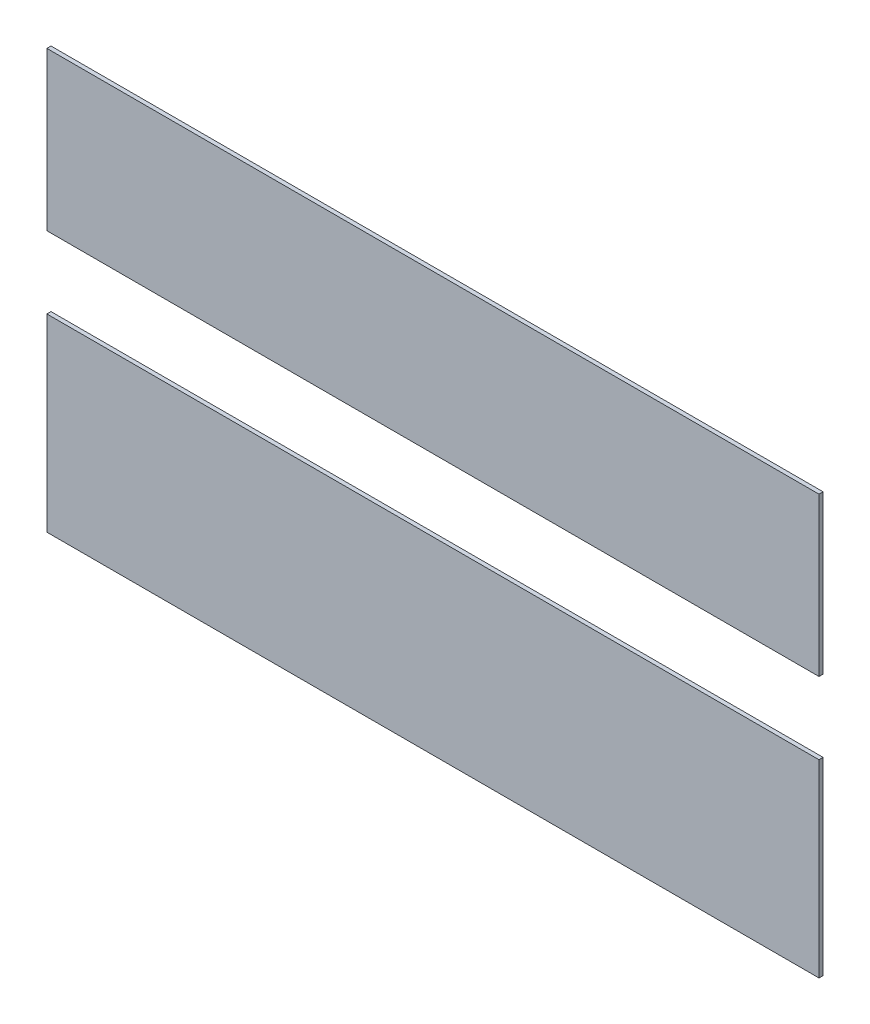
ISO-10303-21;
HEADER;
FILE_DESCRIPTION(('STEP AP214'),'2;1');
FILE_NAME('part.step','',(''),(''),'','','');
FILE_SCHEMA(('AUTOMOTIVE_DESIGN { 1 0 10303 214 1 1 1 1 }'));
ENDSEC;
DATA;
#1=APPLICATION_CONTEXT('core data for automotive mechanical design processes');
#2=APPLICATION_PROTOCOL_DEFINITION('international standard','automotive_design',2000,#1);
#3=PRODUCT_CONTEXT('',#1,'mechanical');
#4=PRODUCT('Part','Part','',(#3));
#5=PRODUCT_RELATED_PRODUCT_CATEGORY('part','',(#4));
#6=PRODUCT_DEFINITION_FORMATION('','',#4);
#7=PRODUCT_DEFINITION_CONTEXT('part definition',#1,'design');
#8=PRODUCT_DEFINITION('design','',#6,#7);
#9=PRODUCT_DEFINITION_SHAPE('','',#8);
#10=(LENGTH_UNIT() NAMED_UNIT(*) SI_UNIT(.MILLI.,.METRE.));
#11=(NAMED_UNIT(*) PLANE_ANGLE_UNIT() SI_UNIT($,.RADIAN.));
#12=(NAMED_UNIT(*) SI_UNIT($,.STERADIAN.) SOLID_ANGLE_UNIT());
#13=UNCERTAINTY_MEASURE_WITH_UNIT(LENGTH_MEASURE(1.E-05),#10,'distance_accuracy_value','');
#14=(GEOMETRIC_REPRESENTATION_CONTEXT(3) GLOBAL_UNCERTAINTY_ASSIGNED_CONTEXT((#13)) GLOBAL_UNIT_ASSIGNED_CONTEXT((#10,
#11,#12)) REPRESENTATION_CONTEXT('',''));
#15=CARTESIAN_POINT('',(0.,0.,0.));
#16=DIRECTION('',(0.,0.,1.));
#17=DIRECTION('',(1.,0.,0.));
#18=AXIS2_PLACEMENT_3D('',#15,#16,#17);
#19=CARTESIAN_POINT('',(9968.34448257996,14202.06060864,2.));
#20=DIRECTION('',(1.,0.,0.));
#21=DIRECTION('',(0.,1.,0.));
#22=AXIS2_PLACEMENT_3D('',#19,#20,#21);
#23=PLANE('',#22);
#24=DIRECTION('',(0.,-1.,0.));
#25=VECTOR('',#24,1.);
#26=CARTESIAN_POINT('',(9968.34448257996,14202.06060864,0.));
#27=LINE('',#26,#25);
#28=CARTESIAN_POINT('',(9968.34448257995,14405.5579740348,0.));
#29=VERTEX_POINT('',#28);
#30=CARTESIAN_POINT('',(9968.34448257995,14328.8579740348,0.));
#31=VERTEX_POINT('',#30);
#32=EDGE_CURVE('E47',#29,#31,#27,.T.);
#33=ORIENTED_EDGE('',*,*,#32,.T.);
#34=DIRECTION('',(0.,0.,1.));
#35=VECTOR('',#34,1.);
#36=CARTESIAN_POINT('',(9968.34448257995,14328.8579740348,-8.));
#37=LINE('',#36,#35);
#38=CARTESIAN_POINT('',(9968.34448257995,14328.8579740348,2.));
#39=VERTEX_POINT('',#38);
#40=EDGE_CURVE('E61',#31,#39,#37,.T.);
#41=ORIENTED_EDGE('',*,*,#40,.T.);
#42=DIRECTION('',(0.,-1.,0.));
#43=VECTOR('',#42,1.);
#44=CARTESIAN_POINT('',(9968.34448257996,14202.06060864,2.));
#45=LINE('',#44,#43);
#46=CARTESIAN_POINT('',(9968.34448257995,14405.5579740348,2.));
#47=VERTEX_POINT('',#46);
#48=EDGE_CURVE('E92',#47,#39,#45,.T.);
#49=ORIENTED_EDGE('',*,*,#48,.F.);
#50=DIRECTION('',(0.,0.,-1.));
#51=VECTOR('',#50,1.);
#52=CARTESIAN_POINT('',(9968.34448257995,14405.5579740348,2.));
#53=LINE('',#52,#51);
#54=EDGE_CURVE('E104',#47,#29,#53,.T.);
#55=ORIENTED_EDGE('',*,*,#54,.T.);
#56=EDGE_LOOP('',(#33,#41,#49,#55));
#57=FACE_BOUND('',#56,.T.);
#58=ADVANCED_FACE('F44',(#57),#23,.F.);
#59=CARTESIAN_POINT('',(10343.3422993769,14405.5579740348,2.));
#60=DIRECTION('',(-1.,0.,0.));
#61=DIRECTION('',(0.,-1.,0.));
#62=AXIS2_PLACEMENT_3D('',#59,#60,#61);
#63=PLANE('',#62);
#64=DIRECTION('',(0.,1.,0.));
#65=VECTOR('',#64,1.);
#66=CARTESIAN_POINT('',(10343.3422993769,14405.5579740348,2.));
#67=LINE('',#66,#65);
#68=CARTESIAN_POINT('',(10343.3422993769,14328.8579740348,2.));
#69=VERTEX_POINT('',#68);
#70=CARTESIAN_POINT('',(10343.3422993769,14405.5579740348,2.));
#71=VERTEX_POINT('',#70);
#72=EDGE_CURVE('E89',#69,#71,#67,.T.);
#73=ORIENTED_EDGE('',*,*,#72,.F.);
#74=DIRECTION('',(0.,0.,1.));
#75=VECTOR('',#74,1.);
#76=CARTESIAN_POINT('',(10343.3422993769,14328.8579740348,-8.));
#77=LINE('',#76,#75);
#78=CARTESIAN_POINT('',(10343.3422993769,14328.8579740348,0.));
#79=VERTEX_POINT('',#78);
#80=EDGE_CURVE('E53',#79,#69,#77,.T.);
#81=ORIENTED_EDGE('',*,*,#80,.F.);
#82=DIRECTION('',(0.,1.,0.));
#83=VECTOR('',#82,1.);
#84=CARTESIAN_POINT('',(10343.3422993769,14405.5579740348,0.));
#85=LINE('',#84,#83);
#86=CARTESIAN_POINT('',(10343.3422993769,14405.5579740348,0.));
#87=VERTEX_POINT('',#86);
#88=EDGE_CURVE('E101',#79,#87,#85,.T.);
#89=ORIENTED_EDGE('',*,*,#88,.T.);
#90=DIRECTION('',(0.,0.,-1.));
#91=VECTOR('',#90,1.);
#92=CARTESIAN_POINT('',(10343.3422993769,14405.5579740348,2.));
#93=LINE('',#92,#91);
#94=EDGE_CURVE('E95',#71,#87,#93,.T.);
#95=ORIENTED_EDGE('',*,*,#94,.F.);
#96=EDGE_LOOP('',(#73,#81,#89,#95));
#97=FACE_BOUND('',#96,.T.);
#98=ADVANCED_FACE('F93',(#97),#63,.F.);
#99=CARTESIAN_POINT('',(0.,0.,2.));
#100=DIRECTION('',(0.,0.,-1.));
#101=DIRECTION('',(-1.,0.,0.));
#102=AXIS2_PLACEMENT_3D('',#99,#100,#101);
#103=PLANE('',#102);
#104=ORIENTED_EDGE('',*,*,#48,.T.);
#105=DIRECTION('',(-1.,0.,0.));
#106=VECTOR('',#105,1.);
#107=CARTESIAN_POINT('',(9968.34448257995,14328.8579740348,2.));
#108=LINE('',#107,#106);
#109=EDGE_CURVE('E12',#69,#39,#108,.T.);
#110=ORIENTED_EDGE('',*,*,#109,.F.);
#111=ORIENTED_EDGE('',*,*,#72,.T.);
#112=DIRECTION('',(-1.,0.,0.));
#113=VECTOR('',#112,1.);
#114=CARTESIAN_POINT('',(10323.34448258,14405.5579740348,2.));
#115=LINE('',#114,#113);
#116=EDGE_CURVE('E97',#71,#47,#115,.T.);
#117=ORIENTED_EDGE('',*,*,#116,.T.);
#118=EDGE_LOOP('',(#104,#110,#111,#117));
#119=FACE_BOUND('',#118,.T.);
#120=ADVANCED_FACE('F88',(#119),#103,.F.);
#121=CARTESIAN_POINT('',(0.,0.,0.));
#122=DIRECTION('',(0.,0.,-1.));
#123=DIRECTION('',(-1.,0.,0.));
#124=AXIS2_PLACEMENT_3D('',#121,#122,#123);
#125=PLANE('',#124);
#126=DIRECTION('',(1.,0.,0.));
#127=VECTOR('',#126,1.);
#128=CARTESIAN_POINT('',(0.,14328.8579740348,0.));
#129=LINE('',#128,#127);
#130=EDGE_CURVE('E78',#31,#79,#129,.T.);
#131=ORIENTED_EDGE('',*,*,#130,.F.);
#132=ORIENTED_EDGE('',*,*,#32,.F.);
#133=DIRECTION('',(-1.,0.,0.));
#134=VECTOR('',#133,1.);
#135=CARTESIAN_POINT('',(9968.34448257995,14405.5579740348,0.));
#136=LINE('',#135,#134);
#137=EDGE_CURVE('E99',#87,#29,#136,.T.);
#138=ORIENTED_EDGE('',*,*,#137,.F.);
#139=ORIENTED_EDGE('',*,*,#88,.F.);
#140=EDGE_LOOP('',(#131,#132,#138,#139));
#141=FACE_BOUND('',#140,.T.);
#142=ADVANCED_FACE('F118',(#141),#125,.T.);
#143=CARTESIAN_POINT('',(9968.34448257995,14405.5579740348,2.));
#144=DIRECTION('',(0.,-1.,0.));
#145=DIRECTION('',(0.,0.,-1.));
#146=AXIS2_PLACEMENT_3D('',#143,#144,#145);
#147=PLANE('',#146);
#148=ORIENTED_EDGE('',*,*,#137,.T.);
#149=ORIENTED_EDGE('',*,*,#54,.F.);
#150=ORIENTED_EDGE('',*,*,#116,.F.);
#151=ORIENTED_EDGE('',*,*,#94,.T.);
#152=EDGE_LOOP('',(#148,#149,#150,#151));
#153=FACE_BOUND('',#152,.T.);
#154=ADVANCED_FACE('F116',(#153),#147,.F.);
#155=CARTESIAN_POINT('',(9968.34448257995,14328.8579740348,-8.));
#156=DIRECTION('',(0.,1.,0.));
#157=DIRECTION('',(0.,0.,1.));
#158=AXIS2_PLACEMENT_3D('',#155,#156,#157);
#159=PLANE('',#158);
#160=ORIENTED_EDGE('',*,*,#130,.T.);
#161=ORIENTED_EDGE('',*,*,#80,.T.);
#162=ORIENTED_EDGE('',*,*,#109,.T.);
#163=ORIENTED_EDGE('',*,*,#40,.F.);
#164=EDGE_LOOP('',(#160,#161,#162,#163));
#165=FACE_BOUND('',#164,.T.);
#166=ADVANCED_FACE('F81',(#165),#159,.F.);
#167=CLOSED_SHELL('',(#58,#98,#120,#142,#154,#166));
#168=MANIFOLD_SOLID_BREP('B2',#167);
#169=CARTESIAN_POINT('',(10343.3422993769,14202.0588568266,2.));
#170=DIRECTION('',(4.67152973470048E-06,0.999999999989088,0.));
#171=DIRECTION('',(-0.999999999989088,4.67152973470048E-06,0.));
#172=AXIS2_PLACEMENT_3D('',#169,#170,#171);
#173=PLANE('',#172);
#174=DIRECTION('',(0.999999999989088,-4.67152973470048E-06,0.));
#175=VECTOR('',#174,1.);
#176=CARTESIAN_POINT('',(10343.3422993769,14202.0588568266,0.));
#177=LINE('',#176,#175);
#178=CARTESIAN_POINT('',(9968.34448257996,14202.06060864,0.));
#179=VERTEX_POINT('',#178);
#180=CARTESIAN_POINT('',(10343.3422993769,14202.0588568266,0.));
#181=VERTEX_POINT('',#180);
#182=EDGE_CURVE('E209',#179,#181,#177,.T.);
#183=ORIENTED_EDGE('',*,*,#182,.T.);
#184=DIRECTION('',(0.,0.,-1.));
#185=VECTOR('',#184,1.);
#186=CARTESIAN_POINT('',(10343.3422993769,14202.0588568266,2.));
#187=LINE('',#186,#185);
#188=CARTESIAN_POINT('',(10343.3422993769,14202.0588568266,2.));
#189=VERTEX_POINT('',#188);
#190=EDGE_CURVE('E211',#189,#181,#187,.T.);
#191=ORIENTED_EDGE('',*,*,#190,.F.);
#192=DIRECTION('',(0.999999999989088,-4.67152973470048E-06,0.));
#193=VECTOR('',#192,1.);
#194=CARTESIAN_POINT('',(10343.3422993769,14202.0588568266,2.));
#195=LINE('',#194,#193);
#196=CARTESIAN_POINT('',(9968.34448257996,14202.06060864,2.));
#197=VERTEX_POINT('',#196);
#198=EDGE_CURVE('E196',#197,#189,#195,.T.);
#199=ORIENTED_EDGE('',*,*,#198,.F.);
#200=DIRECTION('',(0.,0.,-1.));
#201=VECTOR('',#200,1.);
#202=CARTESIAN_POINT('',(9968.34448257996,14202.06060864,2.));
#203=LINE('',#202,#201);
#204=EDGE_CURVE('E181',#197,#179,#203,.T.);
#205=ORIENTED_EDGE('',*,*,#204,.T.);
#206=EDGE_LOOP('',(#183,#191,#199,#205));
#207=FACE_BOUND('',#206,.T.);
#208=ADVANCED_FACE('F173',(#207),#173,.F.);
#209=CARTESIAN_POINT('',(0.,0.,2.));
#210=DIRECTION('',(0.,0.,-1.));
#211=DIRECTION('',(-1.,0.,0.));
#212=AXIS2_PLACEMENT_3D('',#209,#210,#211);
#213=PLANE('',#212);
#214=DIRECTION('',(0.,1.,0.));
#215=VECTOR('',#214,1.);
#216=CARTESIAN_POINT('',(10343.3422993769,14405.5579740348,2.));
#217=LINE('',#216,#215);
#218=CARTESIAN_POINT('',(10343.3422993769,14293.8579740348,2.));
#219=VERTEX_POINT('',#218);
#220=EDGE_CURVE('E223',#189,#219,#217,.T.);
#221=ORIENTED_EDGE('',*,*,#220,.T.);
#222=DIRECTION('',(1.,0.,0.));
#223=VECTOR('',#222,1.);
#224=CARTESIAN_POINT('',(9968.34448257995,14293.8579740348,2.));
#225=LINE('',#224,#223);
#226=CARTESIAN_POINT('',(9968.34448257995,14293.8579740348,2.));
#227=VERTEX_POINT('',#226);
#228=EDGE_CURVE('E236',#227,#219,#225,.T.);
#229=ORIENTED_EDGE('',*,*,#228,.F.);
#230=DIRECTION('',(0.,-1.,0.));
#231=VECTOR('',#230,1.);
#232=CARTESIAN_POINT('',(9968.34448257996,14202.06060864,2.));
#233=LINE('',#232,#231);
#234=EDGE_CURVE('E226',#227,#197,#233,.T.);
#235=ORIENTED_EDGE('',*,*,#234,.T.);
#236=ORIENTED_EDGE('',*,*,#198,.T.);
#237=EDGE_LOOP('',(#221,#229,#235,#236));
#238=FACE_BOUND('',#237,.T.);
#239=ADVANCED_FACE('F245',(#238),#213,.F.);
#240=CARTESIAN_POINT('',(0.,0.,0.));
#241=DIRECTION('',(0.,0.,-1.));
#242=DIRECTION('',(-1.,0.,0.));
#243=AXIS2_PLACEMENT_3D('',#240,#241,#242);
#244=PLANE('',#243);
#245=DIRECTION('',(-1.,0.,0.));
#246=VECTOR('',#245,1.);
#247=CARTESIAN_POINT('',(0.,14293.8579740348,0.));
#248=LINE('',#247,#246);
#249=CARTESIAN_POINT('',(10343.3422993769,14293.8579740348,0.));
#250=VERTEX_POINT('',#249);
#251=CARTESIAN_POINT('',(9968.34448257995,14293.8579740348,0.));
#252=VERTEX_POINT('',#251);
#253=EDGE_CURVE('E42',#250,#252,#248,.T.);
#254=ORIENTED_EDGE('',*,*,#253,.F.);
#255=DIRECTION('',(0.,1.,0.));
#256=VECTOR('',#255,1.);
#257=CARTESIAN_POINT('',(10343.3422993769,14405.5579740348,0.));
#258=LINE('',#257,#256);
#259=EDGE_CURVE('E217',#181,#250,#258,.T.);
#260=ORIENTED_EDGE('',*,*,#259,.F.);
#261=ORIENTED_EDGE('',*,*,#182,.F.);
#262=DIRECTION('',(0.,-1.,0.));
#263=VECTOR('',#262,1.);
#264=CARTESIAN_POINT('',(9968.34448257996,14202.06060864,0.));
#265=LINE('',#264,#263);
#266=EDGE_CURVE('E218',#252,#179,#265,.T.);
#267=ORIENTED_EDGE('',*,*,#266,.F.);
#268=EDGE_LOOP('',(#254,#260,#261,#267));
#269=FACE_BOUND('',#268,.T.);
#270=ADVANCED_FACE('F225',(#269),#244,.T.);
#271=CARTESIAN_POINT('',(10343.3422993769,14405.5579740348,2.));
#272=DIRECTION('',(-1.,0.,0.));
#273=DIRECTION('',(0.,-1.,0.));
#274=AXIS2_PLACEMENT_3D('',#271,#272,#273);
#275=PLANE('',#274);
#276=ORIENTED_EDGE('',*,*,#259,.T.);
#277=DIRECTION('',(0.,0.,1.));
#278=VECTOR('',#277,1.);
#279=CARTESIAN_POINT('',(10343.3422993769,14293.8579740348,-8.));
#280=LINE('',#279,#278);
#281=EDGE_CURVE('E187',#250,#219,#280,.T.);
#282=ORIENTED_EDGE('',*,*,#281,.T.);
#283=ORIENTED_EDGE('',*,*,#220,.F.);
#284=ORIENTED_EDGE('',*,*,#190,.T.);
#285=EDGE_LOOP('',(#276,#282,#283,#284));
#286=FACE_BOUND('',#285,.T.);
#287=ADVANCED_FACE('F222',(#286),#275,.F.);
#288=CARTESIAN_POINT('',(9968.34448257996,14202.06060864,2.));
#289=DIRECTION('',(1.,0.,0.));
#290=DIRECTION('',(0.,1.,0.));
#291=AXIS2_PLACEMENT_3D('',#288,#289,#290);
#292=PLANE('',#291);
#293=ORIENTED_EDGE('',*,*,#234,.F.);
#294=DIRECTION('',(0.,0.,1.));
#295=VECTOR('',#294,1.);
#296=CARTESIAN_POINT('',(9968.34448257995,14293.8579740348,-8.));
#297=LINE('',#296,#295);
#298=EDGE_CURVE('E233',#252,#227,#297,.T.);
#299=ORIENTED_EDGE('',*,*,#298,.F.);
#300=ORIENTED_EDGE('',*,*,#266,.T.);
#301=ORIENTED_EDGE('',*,*,#204,.F.);
#302=EDGE_LOOP('',(#293,#299,#300,#301));
#303=FACE_BOUND('',#302,.T.);
#304=ADVANCED_FACE('F175',(#303),#292,.F.);
#305=CARTESIAN_POINT('',(9968.34448257995,14293.8579740348,-8.));
#306=DIRECTION('',(0.,-1.,0.));
#307=DIRECTION('',(0.,0.,-1.));
#308=AXIS2_PLACEMENT_3D('',#305,#306,#307);
#309=PLANE('',#308);
#310=ORIENTED_EDGE('',*,*,#253,.T.);
#311=ORIENTED_EDGE('',*,*,#298,.T.);
#312=ORIENTED_EDGE('',*,*,#228,.T.);
#313=ORIENTED_EDGE('',*,*,#281,.F.);
#314=EDGE_LOOP('',(#310,#311,#312,#313));
#315=FACE_BOUND('',#314,.T.);
#316=ADVANCED_FACE('F240',(#315),#309,.F.);
#317=CLOSED_SHELL('',(#208,#239,#270,#287,#304,#316));
#318=MANIFOLD_SOLID_BREP('B6',#317);
#319=ADVANCED_BREP_SHAPE_REPRESENTATION('',(#18,#168,#318),#14);
#320=SHAPE_DEFINITION_REPRESENTATION(#9,#319);
ENDSEC;
END-ISO-10303-21;
